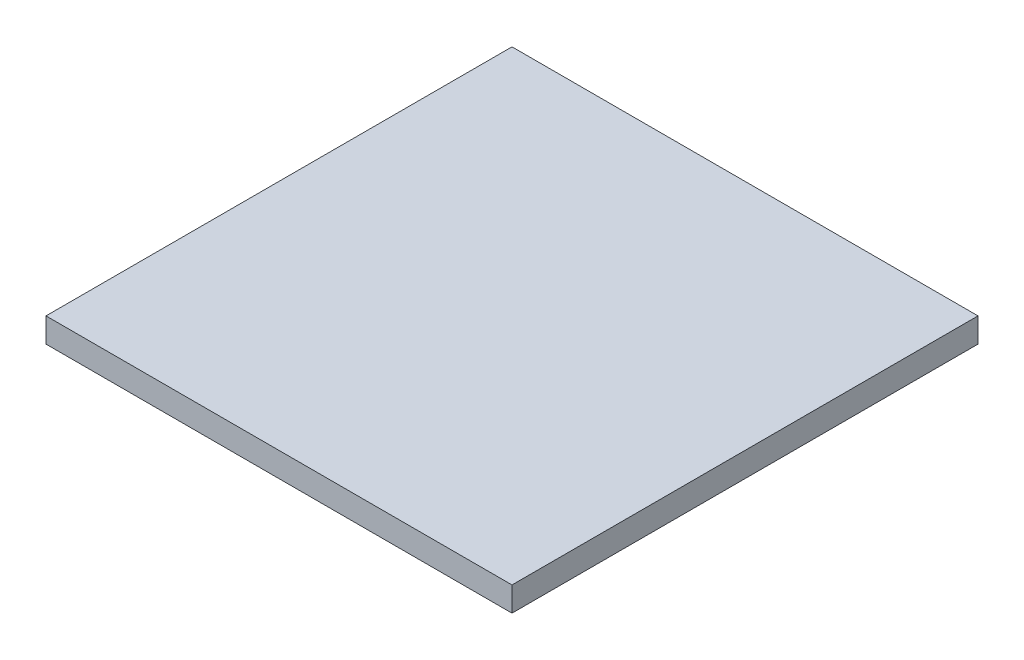
ISO-10303-21;
HEADER;
FILE_DESCRIPTION(('STEP AP214'),'2;1');
FILE_NAME('part.step','',(''),(''),'','','');
FILE_SCHEMA(('AUTOMOTIVE_DESIGN { 1 0 10303 214 1 1 1 1 }'));
ENDSEC;
DATA;
#1=APPLICATION_CONTEXT('core data for automotive mechanical design processes');
#2=APPLICATION_PROTOCOL_DEFINITION('international standard','automotive_design',2000,#1);
#3=PRODUCT_CONTEXT('',#1,'mechanical');
#4=PRODUCT('Part','Part','',(#3));
#5=PRODUCT_RELATED_PRODUCT_CATEGORY('part','',(#4));
#6=PRODUCT_DEFINITION_FORMATION('','',#4);
#7=PRODUCT_DEFINITION_CONTEXT('part definition',#1,'design');
#8=PRODUCT_DEFINITION('design','',#6,#7);
#9=PRODUCT_DEFINITION_SHAPE('','',#8);
#10=(LENGTH_UNIT() NAMED_UNIT(*) SI_UNIT(.MILLI.,.METRE.));
#11=(NAMED_UNIT(*) PLANE_ANGLE_UNIT() SI_UNIT($,.RADIAN.));
#12=(NAMED_UNIT(*) SI_UNIT($,.STERADIAN.) SOLID_ANGLE_UNIT());
#13=UNCERTAINTY_MEASURE_WITH_UNIT(LENGTH_MEASURE(1.E-05),#10,'distance_accuracy_value','');
#14=(GEOMETRIC_REPRESENTATION_CONTEXT(3) GLOBAL_UNCERTAINTY_ASSIGNED_CONTEXT((#13)) GLOBAL_UNIT_ASSIGNED_CONTEXT((#10,
#11,#12)) REPRESENTATION_CONTEXT('',''));
#15=CARTESIAN_POINT('',(0.,0.,0.));
#16=DIRECTION('',(0.,0.,1.));
#17=DIRECTION('',(1.,0.,0.));
#18=AXIS2_PLACEMENT_3D('',#15,#16,#17);
#19=CARTESIAN_POINT('',(-5.,0.525,-5.));
#20=DIRECTION('',(1.,0.,0.));
#21=DIRECTION('',(0.,0.,-1.));
#22=AXIS2_PLACEMENT_3D('',#19,#20,#21);
#23=PLANE('',#22);
#24=DIRECTION('',(0.,0.,1.));
#25=VECTOR('',#24,1.);
#26=CARTESIAN_POINT('',(-5.,0.,-5.));
#27=LINE('',#26,#25);
#28=CARTESIAN_POINT('',(-5.,0.,-5.));
#29=VERTEX_POINT('',#28);
#30=CARTESIAN_POINT('',(-5.,0.,5.));
#31=VERTEX_POINT('',#30);
#32=EDGE_CURVE('E99',#29,#31,#27,.T.);
#33=ORIENTED_EDGE('',*,*,#32,.T.);
#34=DIRECTION('',(0.,-1.,0.));
#35=VECTOR('',#34,1.);
#36=CARTESIAN_POINT('',(-5.,0.525,5.));
#37=LINE('',#36,#35);
#38=CARTESIAN_POINT('',(-5.,0.525,5.));
#39=VERTEX_POINT('',#38);
#40=EDGE_CURVE('E11',#39,#31,#37,.T.);
#41=ORIENTED_EDGE('',*,*,#40,.F.);
#42=DIRECTION('',(0.,0.,1.));
#43=VECTOR('',#42,1.);
#44=CARTESIAN_POINT('',(-5.,0.525,-5.));
#45=LINE('',#44,#43);
#46=CARTESIAN_POINT('',(-5.,0.525,-5.));
#47=VERTEX_POINT('',#46);
#48=EDGE_CURVE('E87',#47,#39,#45,.T.);
#49=ORIENTED_EDGE('',*,*,#48,.F.);
#50=DIRECTION('',(0.,-1.,0.));
#51=VECTOR('',#50,1.);
#52=CARTESIAN_POINT('',(-5.,0.525,-5.));
#53=LINE('',#52,#51);
#54=EDGE_CURVE('E95',#47,#29,#53,.T.);
#55=ORIENTED_EDGE('',*,*,#54,.T.);
#56=EDGE_LOOP('',(#33,#41,#49,#55));
#57=FACE_BOUND('',#56,.T.);
#58=ADVANCED_FACE('F36',(#57),#23,.F.);
#59=CARTESIAN_POINT('',(-5.,0.525,5.));
#60=DIRECTION('',(0.,0.,-1.));
#61=DIRECTION('',(-1.,0.,0.));
#62=AXIS2_PLACEMENT_3D('',#59,#60,#61);
#63=PLANE('',#62);
#64=DIRECTION('',(1.,0.,0.));
#65=VECTOR('',#64,1.);
#66=CARTESIAN_POINT('',(-5.,0.,5.));
#67=LINE('',#66,#65);
#68=CARTESIAN_POINT('',(5.,0.,5.));
#69=VERTEX_POINT('',#68);
#70=EDGE_CURVE('E91',#31,#69,#67,.T.);
#71=ORIENTED_EDGE('',*,*,#70,.T.);
#72=DIRECTION('',(0.,-1.,0.));
#73=VECTOR('',#72,1.);
#74=CARTESIAN_POINT('',(5.,0.525,5.));
#75=LINE('',#74,#73);
#76=CARTESIAN_POINT('',(5.,0.525,5.));
#77=VERTEX_POINT('',#76);
#78=EDGE_CURVE('E44',#77,#69,#75,.T.);
#79=ORIENTED_EDGE('',*,*,#78,.F.);
#80=DIRECTION('',(1.,0.,0.));
#81=VECTOR('',#80,1.);
#82=CARTESIAN_POINT('',(-5.,0.525,5.));
#83=LINE('',#82,#81);
#84=EDGE_CURVE('E82',#39,#77,#83,.T.);
#85=ORIENTED_EDGE('',*,*,#84,.F.);
#86=ORIENTED_EDGE('',*,*,#40,.T.);
#87=EDGE_LOOP('',(#71,#79,#85,#86));
#88=FACE_BOUND('',#87,.T.);
#89=ADVANCED_FACE('F90',(#88),#63,.F.);
#90=CARTESIAN_POINT('',(5.,0.525,-5.));
#91=DIRECTION('',(-1.,0.,0.));
#92=DIRECTION('',(0.,0.,1.));
#93=AXIS2_PLACEMENT_3D('',#90,#91,#92);
#94=PLANE('',#93);
#95=DIRECTION('',(0.,0.,-1.));
#96=VECTOR('',#95,1.);
#97=CARTESIAN_POINT('',(5.,0.,-5.));
#98=LINE('',#97,#96);
#99=CARTESIAN_POINT('',(5.,0.,-5.));
#100=VERTEX_POINT('',#99);
#101=EDGE_CURVE('E69',#69,#100,#98,.T.);
#102=ORIENTED_EDGE('',*,*,#101,.T.);
#103=DIRECTION('',(0.,-1.,0.));
#104=VECTOR('',#103,1.);
#105=CARTESIAN_POINT('',(5.,0.525,-5.));
#106=LINE('',#105,#104);
#107=CARTESIAN_POINT('',(5.,0.525,-5.));
#108=VERTEX_POINT('',#107);
#109=EDGE_CURVE('E92',#108,#100,#106,.T.);
#110=ORIENTED_EDGE('',*,*,#109,.F.);
#111=DIRECTION('',(0.,0.,-1.));
#112=VECTOR('',#111,1.);
#113=CARTESIAN_POINT('',(5.,0.525,-5.));
#114=LINE('',#113,#112);
#115=EDGE_CURVE('E85',#77,#108,#114,.T.);
#116=ORIENTED_EDGE('',*,*,#115,.F.);
#117=ORIENTED_EDGE('',*,*,#78,.T.);
#118=EDGE_LOOP('',(#102,#110,#116,#117));
#119=FACE_BOUND('',#118,.T.);
#120=ADVANCED_FACE('F93',(#119),#94,.F.);
#121=CARTESIAN_POINT('',(-5.,0.525,-5.));
#122=DIRECTION('',(0.,0.,1.));
#123=DIRECTION('',(1.,0.,0.));
#124=AXIS2_PLACEMENT_3D('',#121,#122,#123);
#125=PLANE('',#124);
#126=DIRECTION('',(-1.,0.,0.));
#127=VECTOR('',#126,1.);
#128=CARTESIAN_POINT('',(-5.,0.,-5.));
#129=LINE('',#128,#127);
#130=EDGE_CURVE('E75',#100,#29,#129,.T.);
#131=ORIENTED_EDGE('',*,*,#130,.T.);
#132=ORIENTED_EDGE('',*,*,#54,.F.);
#133=DIRECTION('',(-1.,0.,0.));
#134=VECTOR('',#133,1.);
#135=CARTESIAN_POINT('',(-5.,0.525,-5.));
#136=LINE('',#135,#134);
#137=EDGE_CURVE('E52',#108,#47,#136,.T.);
#138=ORIENTED_EDGE('',*,*,#137,.F.);
#139=ORIENTED_EDGE('',*,*,#109,.T.);
#140=EDGE_LOOP('',(#131,#132,#138,#139));
#141=FACE_BOUND('',#140,.T.);
#142=ADVANCED_FACE('F106',(#141),#125,.F.);
#143=CARTESIAN_POINT('',(0.,0.525,0.));
#144=DIRECTION('',(0.,1.,0.));
#145=DIRECTION('',(0.,0.,1.));
#146=AXIS2_PLACEMENT_3D('',#143,#144,#145);
#147=PLANE('',#146);
#148=ORIENTED_EDGE('',*,*,#48,.T.);
#149=ORIENTED_EDGE('',*,*,#84,.T.);
#150=ORIENTED_EDGE('',*,*,#115,.T.);
#151=ORIENTED_EDGE('',*,*,#137,.T.);
#152=EDGE_LOOP('',(#148,#149,#150,#151));
#153=FACE_BOUND('',#152,.T.);
#154=ADVANCED_FACE('F83',(#153),#147,.T.);
#155=CARTESIAN_POINT('',(0.,0.,0.));
#156=DIRECTION('',(0.,1.,0.));
#157=DIRECTION('',(0.,0.,1.));
#158=AXIS2_PLACEMENT_3D('',#155,#156,#157);
#159=PLANE('',#158);
#160=ORIENTED_EDGE('',*,*,#32,.F.);
#161=ORIENTED_EDGE('',*,*,#130,.F.);
#162=ORIENTED_EDGE('',*,*,#101,.F.);
#163=ORIENTED_EDGE('',*,*,#70,.F.);
#164=EDGE_LOOP('',(#160,#161,#162,#163));
#165=FACE_BOUND('',#164,.T.);
#166=ADVANCED_FACE('F109',(#165),#159,.F.);
#167=CLOSED_SHELL('',(#58,#89,#120,#142,#154,#166));
#168=MANIFOLD_SOLID_BREP('B2',#167);
#169=ADVANCED_BREP_SHAPE_REPRESENTATION('',(#18,#168),#14);
#170=SHAPE_DEFINITION_REPRESENTATION(#9,#169);
ENDSEC;
END-ISO-10303-21;
